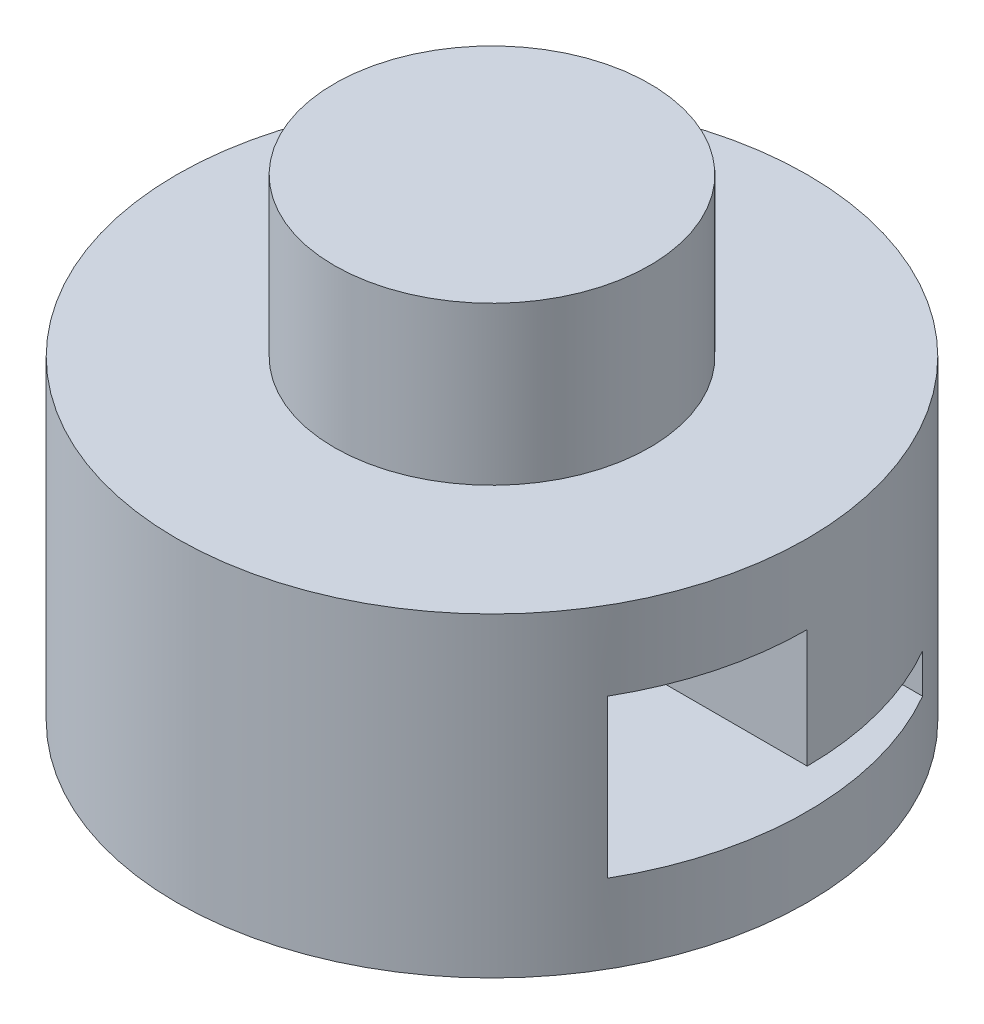
ISO-10303-21;
HEADER;
FILE_DESCRIPTION(('STEP AP214'),'2;1');
FILE_NAME('part.step','',(''),(''),'','','');
FILE_SCHEMA(('AUTOMOTIVE_DESIGN { 1 0 10303 214 1 1 1 1 }'));
ENDSEC;
DATA;
#1=APPLICATION_CONTEXT('core data for automotive mechanical design processes');
#2=APPLICATION_PROTOCOL_DEFINITION('international standard','automotive_design',2000,#1);
#3=PRODUCT_CONTEXT('',#1,'mechanical');
#4=PRODUCT('Part','Part','',(#3));
#5=PRODUCT_RELATED_PRODUCT_CATEGORY('part','',(#4));
#6=PRODUCT_DEFINITION_FORMATION('','',#4);
#7=PRODUCT_DEFINITION_CONTEXT('part definition',#1,'design');
#8=PRODUCT_DEFINITION('design','',#6,#7);
#9=PRODUCT_DEFINITION_SHAPE('','',#8);
#10=(LENGTH_UNIT() NAMED_UNIT(*) SI_UNIT(.MILLI.,.METRE.));
#11=(NAMED_UNIT(*) PLANE_ANGLE_UNIT() SI_UNIT($,.RADIAN.));
#12=(NAMED_UNIT(*) SI_UNIT($,.STERADIAN.) SOLID_ANGLE_UNIT());
#13=UNCERTAINTY_MEASURE_WITH_UNIT(LENGTH_MEASURE(1.E-05),#10,'distance_accuracy_value','');
#14=(GEOMETRIC_REPRESENTATION_CONTEXT(3) GLOBAL_UNCERTAINTY_ASSIGNED_CONTEXT((#13)) GLOBAL_UNIT_ASSIGNED_CONTEXT((#10,
#11,#12)) REPRESENTATION_CONTEXT('',''));
#15=CARTESIAN_POINT('',(0.,0.,0.));
#16=DIRECTION('',(0.,0.,1.));
#17=DIRECTION('',(1.,0.,0.));
#18=AXIS2_PLACEMENT_3D('',#15,#16,#17);
#19=CARTESIAN_POINT('',(0.,25.4,0.));
#20=DIRECTION('',(0.,-1.,0.));
#21=DIRECTION('',(0.,0.,-1.));
#22=AXIS2_PLACEMENT_3D('',#19,#20,#21);
#23=CYLINDRICAL_SURFACE('',#22,25.4);
#24=DIRECTION('',(0.,-1.,0.));
#25=VECTOR('',#24,1.);
#26=CARTESIAN_POINT('',(-21.9970452561247,25.4,12.7));
#27=LINE('',#26,#25);
#28=CARTESIAN_POINT('',(-21.9970452561247,19.05,12.7));
#29=VERTEX_POINT('',#28);
#30=CARTESIAN_POINT('',(-21.9970452561247,6.35,12.7));
#31=VERTEX_POINT('',#30);
#32=EDGE_CURVE('E11',#29,#31,#27,.T.);
#33=ORIENTED_EDGE('',*,*,#32,.T.);
#34=CARTESIAN_POINT('',(0.,6.35,0.));
#35=DIRECTION('',(0.,-1.,0.));
#36=DIRECTION('',(0.,0.,-1.));
#37=AXIS2_PLACEMENT_3D('',#34,#35,#36);
#38=CIRCLE('',#37,25.4);
#39=CARTESIAN_POINT('',(-21.9970452561247,6.35,-12.7));
#40=VERTEX_POINT('',#39);
#41=EDGE_CURVE('E124',#31,#40,#38,.T.);
#42=ORIENTED_EDGE('',*,*,#41,.T.);
#43=DIRECTION('',(0.,-1.,0.));
#44=VECTOR('',#43,1.);
#45=CARTESIAN_POINT('',(-21.9970452561247,25.4,-12.7));
#46=LINE('',#45,#44);
#47=CARTESIAN_POINT('',(-21.9970452561247,9.525,-12.7));
#48=VERTEX_POINT('',#47);
#49=EDGE_CURVE('E132',#40,#48,#46,.F.);
#50=ORIENTED_EDGE('',*,*,#49,.T.);
#51=CARTESIAN_POINT('',(0.,9.525,0.));
#52=DIRECTION('',(0.,1.,0.));
#53=DIRECTION('',(0.,0.,1.));
#54=AXIS2_PLACEMENT_3D('',#51,#52,#53);
#55=CIRCLE('',#54,25.4);
#56=CARTESIAN_POINT('',(-25.4,9.525,0.));
#57=VERTEX_POINT('',#56);
#58=EDGE_CURVE('E127',#48,#57,#55,.T.);
#59=ORIENTED_EDGE('',*,*,#58,.T.);
#60=DIRECTION('',(0.,1.,0.));
#61=VECTOR('',#60,1.);
#62=CARTESIAN_POINT('',(-25.4,19.05,0.));
#63=LINE('',#62,#61);
#64=CARTESIAN_POINT('',(-25.4,19.05,0.));
#65=VERTEX_POINT('',#64);
#66=EDGE_CURVE('E111',#57,#65,#63,.T.);
#67=ORIENTED_EDGE('',*,*,#66,.T.);
#68=CARTESIAN_POINT('',(0.,19.05,0.));
#69=DIRECTION('',(0.,1.,0.));
#70=DIRECTION('',(0.,0.,1.));
#71=AXIS2_PLACEMENT_3D('',#68,#69,#70);
#72=CIRCLE('',#71,25.4);
#73=EDGE_CURVE('E53',#65,#29,#72,.T.);
#74=ORIENTED_EDGE('',*,*,#73,.T.);
#75=EDGE_LOOP('',(#33,#42,#50,#59,#67,#74));
#76=FACE_BOUND('',#75,.T.);
#77=DIRECTION('',(0.,-1.,0.));
#78=VECTOR('',#77,1.);
#79=CARTESIAN_POINT('',(21.9970452561247,25.4,-12.7));
#80=LINE('',#79,#78);
#81=CARTESIAN_POINT('',(21.9970452561247,9.525,-12.7));
#82=VERTEX_POINT('',#81);
#83=CARTESIAN_POINT('',(21.9970452561247,6.35,-12.7));
#84=VERTEX_POINT('',#83);
#85=EDGE_CURVE('E119',#82,#84,#80,.T.);
#86=ORIENTED_EDGE('',*,*,#85,.T.);
#87=CARTESIAN_POINT('',(21.9970452561247,6.35,12.7));
#88=VERTEX_POINT('',#87);
#89=EDGE_CURVE('E138',#84,#88,#38,.T.);
#90=ORIENTED_EDGE('',*,*,#89,.T.);
#91=DIRECTION('',(0.,-1.,0.));
#92=VECTOR('',#91,1.);
#93=CARTESIAN_POINT('',(21.9970452561247,25.4,12.7));
#94=LINE('',#93,#92);
#95=CARTESIAN_POINT('',(21.9970452561247,19.05,12.7));
#96=VERTEX_POINT('',#95);
#97=EDGE_CURVE('E117',#88,#96,#94,.F.);
#98=ORIENTED_EDGE('',*,*,#97,.T.);
#99=CARTESIAN_POINT('',(25.4,19.05,0.));
#100=VERTEX_POINT('',#99);
#101=EDGE_CURVE('E98',#96,#100,#72,.T.);
#102=ORIENTED_EDGE('',*,*,#101,.T.);
#103=DIRECTION('',(0.,1.,0.));
#104=VECTOR('',#103,1.);
#105=CARTESIAN_POINT('',(25.4,19.05,0.));
#106=LINE('',#105,#104);
#107=CARTESIAN_POINT('',(25.4,9.525,0.));
#108=VERTEX_POINT('',#107);
#109=EDGE_CURVE('E106',#108,#100,#106,.T.);
#110=ORIENTED_EDGE('',*,*,#109,.F.);
#111=EDGE_CURVE('E120',#108,#82,#55,.T.);
#112=ORIENTED_EDGE('',*,*,#111,.T.);
#113=EDGE_LOOP('',(#86,#90,#98,#102,#110,#112));
#114=FACE_BOUND('',#113,.T.);
#115=CARTESIAN_POINT('',(0.,25.4,0.));
#116=DIRECTION('',(0.,1.,0.));
#117=DIRECTION('',(0.,0.,1.));
#118=AXIS2_PLACEMENT_3D('',#115,#116,#117);
#119=CIRCLE('',#118,25.4);
#120=CARTESIAN_POINT('',(0.,25.4,25.4));
#121=VERTEX_POINT('',#120);
#122=EDGE_CURVE('E146',#121,#121,#119,.T.);
#123=ORIENTED_EDGE('',*,*,#122,.F.);
#124=EDGE_LOOP('',(#123));
#125=FACE_BOUND('',#124,.T.);
#126=CARTESIAN_POINT('',(0.,0.,0.));
#127=DIRECTION('',(0.,1.,0.));
#128=DIRECTION('',(0.,0.,1.));
#129=AXIS2_PLACEMENT_3D('',#126,#127,#128);
#130=CIRCLE('',#129,25.4);
#131=CARTESIAN_POINT('',(0.,0.,25.4));
#132=VERTEX_POINT('',#131);
#133=EDGE_CURVE('E142',#132,#132,#130,.T.);
#134=ORIENTED_EDGE('',*,*,#133,.T.);
#135=EDGE_LOOP('',(#134));
#136=FACE_BOUND('',#135,.T.);
#137=ADVANCED_FACE('F45',(#76,#114,#125,#136),#23,.T.);
#138=CARTESIAN_POINT('',(0.,25.4,0.));
#139=DIRECTION('',(0.,1.,0.));
#140=DIRECTION('',(0.,0.,1.));
#141=AXIS2_PLACEMENT_3D('',#138,#139,#140);
#142=PLANE('',#141);
#143=CARTESIAN_POINT('',(0.,25.4,0.));
#144=DIRECTION('',(0.,1.,0.));
#145=DIRECTION('',(0.,0.,1.));
#146=AXIS2_PLACEMENT_3D('',#143,#144,#145);
#147=CIRCLE('',#146,12.7);
#148=CARTESIAN_POINT('',(0.,25.4,12.7));
#149=VERTEX_POINT('',#148);
#150=EDGE_CURVE('E141',#149,#149,#147,.T.);
#151=ORIENTED_EDGE('',*,*,#150,.F.);
#152=EDGE_LOOP('',(#151));
#153=FACE_BOUND('',#152,.T.);
#154=ORIENTED_EDGE('',*,*,#122,.T.);
#155=EDGE_LOOP('',(#154));
#156=FACE_BOUND('',#155,.T.);
#157=ADVANCED_FACE('F176',(#153,#156),#142,.T.);
#158=CARTESIAN_POINT('',(0.,0.,0.));
#159=DIRECTION('',(0.,1.,0.));
#160=DIRECTION('',(0.,0.,1.));
#161=AXIS2_PLACEMENT_3D('',#158,#159,#160);
#162=PLANE('',#161);
#163=ORIENTED_EDGE('',*,*,#133,.F.);
#164=EDGE_LOOP('',(#163));
#165=FACE_BOUND('',#164,.T.);
#166=ADVANCED_FACE('F182',(#165),#162,.F.);
#167=CARTESIAN_POINT('',(0.,38.1,0.));
#168=DIRECTION('',(0.,-1.,0.));
#169=DIRECTION('',(0.,0.,-1.));
#170=AXIS2_PLACEMENT_3D('',#167,#168,#169);
#171=CYLINDRICAL_SURFACE('',#170,12.7);
#172=CARTESIAN_POINT('',(0.,38.1,0.));
#173=DIRECTION('',(0.,1.,0.));
#174=DIRECTION('',(0.,0.,1.));
#175=AXIS2_PLACEMENT_3D('',#172,#173,#174);
#176=CIRCLE('',#175,12.7);
#177=CARTESIAN_POINT('',(0.,38.1,12.7));
#178=VERTEX_POINT('',#177);
#179=EDGE_CURVE('E147',#178,#178,#176,.T.);
#180=ORIENTED_EDGE('',*,*,#179,.F.);
#181=EDGE_LOOP('',(#180));
#182=FACE_BOUND('',#181,.T.);
#183=ORIENTED_EDGE('',*,*,#150,.T.);
#184=EDGE_LOOP('',(#183));
#185=FACE_BOUND('',#184,.T.);
#186=ADVANCED_FACE('F189',(#182,#185),#171,.T.);
#187=CARTESIAN_POINT('',(0.,38.1,0.));
#188=DIRECTION('',(0.,1.,0.));
#189=DIRECTION('',(0.,0.,1.));
#190=AXIS2_PLACEMENT_3D('',#187,#188,#189);
#191=PLANE('',#190);
#192=ORIENTED_EDGE('',*,*,#179,.T.);
#193=EDGE_LOOP('',(#192));
#194=FACE_BOUND('',#193,.T.);
#195=ADVANCED_FACE('F195',(#194),#191,.T.);
#196=CARTESIAN_POINT('',(-25.4,6.35,12.7));
#197=DIRECTION('',(0.,0.,1.));
#198=DIRECTION('',(0.,-1.,0.));
#199=AXIS2_PLACEMENT_3D('',#196,#197,#198);
#200=PLANE('',#199);
#201=DIRECTION('',(1.,0.,0.));
#202=VECTOR('',#201,1.);
#203=CARTESIAN_POINT('',(-25.4,19.05,12.7));
#204=LINE('',#203,#202);
#205=EDGE_CURVE('E103',#29,#96,#204,.T.);
#206=ORIENTED_EDGE('',*,*,#205,.T.);
#207=ORIENTED_EDGE('',*,*,#97,.F.);
#208=DIRECTION('',(1.,0.,0.));
#209=VECTOR('',#208,1.);
#210=CARTESIAN_POINT('',(-25.4,6.35,12.7));
#211=LINE('',#210,#209);
#212=EDGE_CURVE('E157',#31,#88,#211,.T.);
#213=ORIENTED_EDGE('',*,*,#212,.F.);
#214=ORIENTED_EDGE('',*,*,#32,.F.);
#215=EDGE_LOOP('',(#206,#207,#213,#214));
#216=FACE_BOUND('',#215,.T.);
#217=ADVANCED_FACE('F198',(#216),#200,.F.);
#218=CARTESIAN_POINT('',(-25.4,19.05,12.7));
#219=DIRECTION('',(0.,1.,0.));
#220=DIRECTION('',(0.,0.,1.));
#221=AXIS2_PLACEMENT_3D('',#218,#219,#220);
#222=PLANE('',#221);
#223=ORIENTED_EDGE('',*,*,#205,.F.);
#224=ORIENTED_EDGE('',*,*,#73,.F.);
#225=DIRECTION('',(1.,0.,0.));
#226=VECTOR('',#225,1.);
#227=CARTESIAN_POINT('',(-25.4,19.05,0.));
#228=LINE('',#227,#226);
#229=EDGE_CURVE('E60',#65,#100,#228,.T.);
#230=ORIENTED_EDGE('',*,*,#229,.T.);
#231=ORIENTED_EDGE('',*,*,#101,.F.);
#232=EDGE_LOOP('',(#223,#224,#230,#231));
#233=FACE_BOUND('',#232,.T.);
#234=ADVANCED_FACE('F96',(#233),#222,.F.);
#235=CARTESIAN_POINT('',(-25.4,9.525,0.));
#236=DIRECTION('',(0.,1.,0.));
#237=DIRECTION('',(0.,0.,1.));
#238=AXIS2_PLACEMENT_3D('',#235,#236,#237);
#239=PLANE('',#238);
#240=DIRECTION('',(1.,0.,0.));
#241=VECTOR('',#240,1.);
#242=CARTESIAN_POINT('',(-25.4,9.525,0.));
#243=LINE('',#242,#241);
#244=EDGE_CURVE('E65',#57,#108,#243,.T.);
#245=ORIENTED_EDGE('',*,*,#244,.F.);
#246=ORIENTED_EDGE('',*,*,#58,.F.);
#247=DIRECTION('',(1.,0.,0.));
#248=VECTOR('',#247,1.);
#249=CARTESIAN_POINT('',(-25.4,9.525,-12.7));
#250=LINE('',#249,#248);
#251=EDGE_CURVE('E165',#48,#82,#250,.T.);
#252=ORIENTED_EDGE('',*,*,#251,.T.);
#253=ORIENTED_EDGE('',*,*,#111,.F.);
#254=EDGE_LOOP('',(#245,#246,#252,#253));
#255=FACE_BOUND('',#254,.T.);
#256=ADVANCED_FACE('F209',(#255),#239,.F.);
#257=CARTESIAN_POINT('',(-25.4,9.525,-12.7));
#258=DIRECTION('',(0.,0.,-1.));
#259=DIRECTION('',(0.,1.,0.));
#260=AXIS2_PLACEMENT_3D('',#257,#258,#259);
#261=PLANE('',#260);
#262=ORIENTED_EDGE('',*,*,#251,.F.);
#263=ORIENTED_EDGE('',*,*,#49,.F.);
#264=DIRECTION('',(1.,0.,0.));
#265=VECTOR('',#264,1.);
#266=CARTESIAN_POINT('',(-25.4,6.35,-12.7));
#267=LINE('',#266,#265);
#268=EDGE_CURVE('E161',#40,#84,#267,.T.);
#269=ORIENTED_EDGE('',*,*,#268,.T.);
#270=ORIENTED_EDGE('',*,*,#85,.F.);
#271=EDGE_LOOP('',(#262,#263,#269,#270));
#272=FACE_BOUND('',#271,.T.);
#273=ADVANCED_FACE('F205',(#272),#261,.F.);
#274=CARTESIAN_POINT('',(-25.4,6.35,-12.7));
#275=DIRECTION('',(0.,-1.,0.));
#276=DIRECTION('',(0.,0.,-1.));
#277=AXIS2_PLACEMENT_3D('',#274,#275,#276);
#278=PLANE('',#277);
#279=ORIENTED_EDGE('',*,*,#268,.F.);
#280=ORIENTED_EDGE('',*,*,#41,.F.);
#281=ORIENTED_EDGE('',*,*,#212,.T.);
#282=ORIENTED_EDGE('',*,*,#89,.F.);
#283=EDGE_LOOP('',(#279,#280,#281,#282));
#284=FACE_BOUND('',#283,.T.);
#285=ADVANCED_FACE('F202',(#284),#278,.F.);
#286=CARTESIAN_POINT('',(-25.4,19.05,0.));
#287=DIRECTION('',(0.,0.,-1.));
#288=DIRECTION('',(0.,1.,0.));
#289=AXIS2_PLACEMENT_3D('',#286,#287,#288);
#290=PLANE('',#289);
#291=ORIENTED_EDGE('',*,*,#229,.F.);
#292=ORIENTED_EDGE('',*,*,#66,.F.);
#293=ORIENTED_EDGE('',*,*,#244,.T.);
#294=ORIENTED_EDGE('',*,*,#109,.T.);
#295=EDGE_LOOP('',(#291,#292,#293,#294));
#296=FACE_BOUND('',#295,.T.);
#297=ADVANCED_FACE('F107',(#296),#290,.F.);
#298=CLOSED_SHELL('',(#137,#157,#166,#186,#195,#217,#234,#256,#273,#285,#297));
#299=MANIFOLD_SOLID_BREP('B2',#298);
#300=ADVANCED_BREP_SHAPE_REPRESENTATION('',(#18,#299),#14);
#301=SHAPE_DEFINITION_REPRESENTATION(#9,#300);
ENDSEC;
END-ISO-10303-21;
